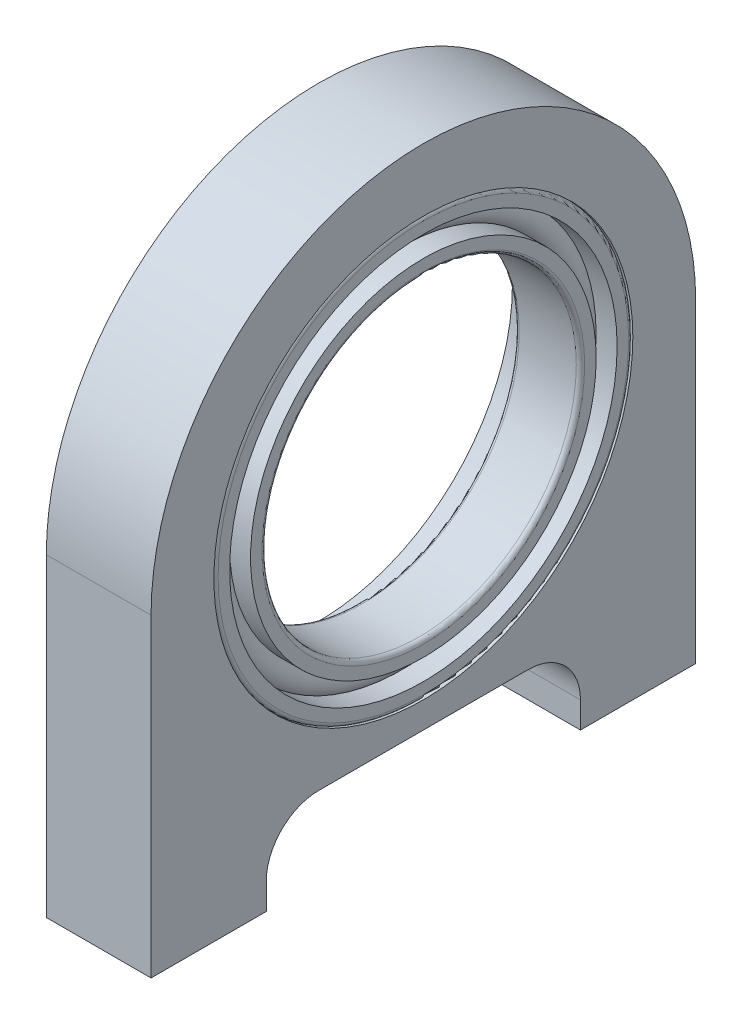
ISO-10303-21;
HEADER;
FILE_DESCRIPTION(('STEP AP214'),'2;1');
FILE_NAME('part.step','',(''),(''),'','','');
FILE_SCHEMA(('AUTOMOTIVE_DESIGN { 1 0 10303 214 1 1 1 1 }'));
ENDSEC;
DATA;
#1=APPLICATION_CONTEXT('core data for automotive mechanical design processes');
#2=APPLICATION_PROTOCOL_DEFINITION('international standard','automotive_design',2000,#1);
#3=PRODUCT_CONTEXT('',#1,'mechanical');
#4=PRODUCT('Part','Part','',(#3));
#5=PRODUCT_RELATED_PRODUCT_CATEGORY('part','',(#4));
#6=PRODUCT_DEFINITION_FORMATION('','',#4);
#7=PRODUCT_DEFINITION_CONTEXT('part definition',#1,'design');
#8=PRODUCT_DEFINITION('design','',#6,#7);
#9=PRODUCT_DEFINITION_SHAPE('','',#8);
#10=(LENGTH_UNIT() NAMED_UNIT(*) SI_UNIT(.MILLI.,.METRE.));
#11=(NAMED_UNIT(*) PLANE_ANGLE_UNIT() SI_UNIT($,.RADIAN.));
#12=(NAMED_UNIT(*) SI_UNIT($,.STERADIAN.) SOLID_ANGLE_UNIT());
#13=UNCERTAINTY_MEASURE_WITH_UNIT(LENGTH_MEASURE(1.E-05),#10,'distance_accuracy_value','');
#14=(GEOMETRIC_REPRESENTATION_CONTEXT(3) GLOBAL_UNCERTAINTY_ASSIGNED_CONTEXT((#13)) GLOBAL_UNIT_ASSIGNED_CONTEXT((#10,
#11,#12)) REPRESENTATION_CONTEXT('',''));
#15=CARTESIAN_POINT('',(0.,0.,0.));
#16=DIRECTION('',(0.,0.,1.));
#17=DIRECTION('',(1.,0.,0.));
#18=AXIS2_PLACEMENT_3D('',#15,#16,#17);
#19=CARTESIAN_POINT('',(0.,0.,0.));
#20=DIRECTION('',(-1.,0.,0.));
#21=DIRECTION('',(0.,0.,1.));
#22=AXIS2_PLACEMENT_3D('',#19,#20,#21);
#23=TOROIDAL_SURFACE('',#22,11.1125,0.9525);
#24=CARTESIAN_POINT('',(0.709951582856175,0.,0.));
#25=DIRECTION('',(-1.,0.,0.));
#26=DIRECTION('',(0.,0.,1.));
#27=AXIS2_PLACEMENT_3D('',#24,#25,#26);
#28=CIRCLE('',#27,11.7475);
#29=CARTESIAN_POINT('',(0.709951582856175,0.,11.7475));
#30=VERTEX_POINT('',#29);
#31=EDGE_CURVE('E213',#30,#30,#28,.F.);
#32=ORIENTED_EDGE('',*,*,#31,.T.);
#33=EDGE_LOOP('',(#32));
#34=FACE_BOUND('',#33,.T.);
#35=CARTESIAN_POINT('',(0.709951582856181,0.,0.));
#36=DIRECTION('',(-1.,0.,0.));
#37=DIRECTION('',(0.,0.,1.));
#38=AXIS2_PLACEMENT_3D('',#35,#36,#37);
#39=CIRCLE('',#38,10.4775);
#40=CARTESIAN_POINT('',(0.709951582856181,0.,10.4775));
#41=VERTEX_POINT('',#40);
#42=EDGE_CURVE('E46',#41,#41,#39,.T.);
#43=ORIENTED_EDGE('',*,*,#42,.T.);
#44=EDGE_LOOP('',(#43));
#45=FACE_BOUND('',#44,.T.);
#46=ADVANCED_FACE('F36',(#34,#45),#23,.T.);
#47=CARTESIAN_POINT('',(-20.6375,0.,0.));
#48=DIRECTION('',(1.,0.,0.));
#49=DIRECTION('',(0.,0.,-1.));
#50=AXIS2_PLACEMENT_3D('',#47,#48,#49);
#51=CYLINDRICAL_SURFACE('',#50,10.4775);
#52=CARTESIAN_POINT('',(1.98374,0.,0.));
#53=DIRECTION('',(1.,0.,0.));
#54=DIRECTION('',(0.,0.,-1.));
#55=AXIS2_PLACEMENT_3D('',#52,#53,#54);
#56=CIRCLE('',#55,10.4775);
#57=CARTESIAN_POINT('',(1.98374,0.,-10.4775));
#58=VERTEX_POINT('',#57);
#59=EDGE_CURVE('E225',#58,#58,#56,.T.);
#60=ORIENTED_EDGE('',*,*,#59,.F.);
#61=EDGE_LOOP('',(#60));
#62=FACE_BOUND('',#61,.T.);
#63=ORIENTED_EDGE('',*,*,#42,.F.);
#64=EDGE_LOOP('',(#63));
#65=FACE_BOUND('',#64,.T.);
#66=ADVANCED_FACE('F256',(#62,#65),#51,.T.);
#67=CARTESIAN_POINT('',(-20.6375,0.,0.));
#68=DIRECTION('',(1.,0.,0.));
#69=DIRECTION('',(0.,0.,-1.));
#70=AXIS2_PLACEMENT_3D('',#67,#68,#69);
#71=CYLINDRICAL_SURFACE('',#70,10.4775);
#72=CARTESIAN_POINT('',(-1.98374,0.,0.));
#73=DIRECTION('',(1.,0.,0.));
#74=DIRECTION('',(0.,0.,-1.));
#75=AXIS2_PLACEMENT_3D('',#72,#73,#74);
#76=CIRCLE('',#75,10.4775);
#77=CARTESIAN_POINT('',(-1.98374,0.,-10.4775));
#78=VERTEX_POINT('',#77);
#79=EDGE_CURVE('E209',#78,#78,#76,.T.);
#80=ORIENTED_EDGE('',*,*,#79,.T.);
#81=EDGE_LOOP('',(#80));
#82=FACE_BOUND('',#81,.T.);
#83=CARTESIAN_POINT('',(-0.709951582856181,0.,0.));
#84=DIRECTION('',(1.,0.,0.));
#85=DIRECTION('',(0.,0.,-1.));
#86=AXIS2_PLACEMENT_3D('',#83,#84,#85);
#87=CIRCLE('',#86,10.4775);
#88=CARTESIAN_POINT('',(-0.709951582856181,0.,-10.4775));
#89=VERTEX_POINT('',#88);
#90=EDGE_CURVE('E228',#89,#89,#87,.T.);
#91=ORIENTED_EDGE('',*,*,#90,.F.);
#92=EDGE_LOOP('',(#91));
#93=FACE_BOUND('',#92,.T.);
#94=ADVANCED_FACE('F260',(#82,#93),#71,.T.);
#95=CARTESIAN_POINT('',(1.98374,9.779,0.));
#96=DIRECTION('',(1.,0.,0.));
#97=DIRECTION('',(0.,0.,-1.));
#98=AXIS2_PLACEMENT_3D('',#95,#96,#97);
#99=PLANE('',#98);
#100=ORIENTED_EDGE('',*,*,#59,.T.);
#101=EDGE_LOOP('',(#100));
#102=FACE_BOUND('',#101,.T.);
#103=CARTESIAN_POINT('',(1.98374,0.,0.));
#104=DIRECTION('',(1.,0.,0.));
#105=DIRECTION('',(0.,0.,-1.));
#106=AXIS2_PLACEMENT_3D('',#103,#104,#105);
#107=CIRCLE('',#106,9.779);
#108=CARTESIAN_POINT('',(1.98374,0.,-9.779));
#109=VERTEX_POINT('',#108);
#110=EDGE_CURVE('E222',#109,#109,#107,.T.);
#111=ORIENTED_EDGE('',*,*,#110,.F.);
#112=EDGE_LOOP('',(#111));
#113=FACE_BOUND('',#112,.T.);
#114=ADVANCED_FACE('F265',(#102,#113),#99,.T.);
#115=CARTESIAN_POINT('',(1.72974,0.,0.));
#116=DIRECTION('',(1.,0.,0.));
#117=DIRECTION('',(0.,0.,-1.));
#118=AXIS2_PLACEMENT_3D('',#115,#116,#117);
#119=TOROIDAL_SURFACE('',#118,9.779,0.254);
#120=ORIENTED_EDGE('',*,*,#110,.T.);
#121=EDGE_LOOP('',(#120));
#122=FACE_BOUND('',#121,.T.);
#123=CARTESIAN_POINT('',(1.72974,0.,0.));
#124=DIRECTION('',(1.,0.,0.));
#125=DIRECTION('',(0.,0.,-1.));
#126=AXIS2_PLACEMENT_3D('',#123,#124,#125);
#127=CIRCLE('',#126,9.525);
#128=CARTESIAN_POINT('',(1.72974,0.,-9.525));
#129=VERTEX_POINT('',#128);
#130=EDGE_CURVE('E219',#129,#129,#127,.T.);
#131=ORIENTED_EDGE('',*,*,#130,.F.);
#132=EDGE_LOOP('',(#131));
#133=FACE_BOUND('',#132,.T.);
#134=ADVANCED_FACE('F272',(#122,#133),#119,.T.);
#135=CARTESIAN_POINT('',(-20.6375,0.,0.));
#136=DIRECTION('',(1.,0.,0.));
#137=DIRECTION('',(0.,0.,-1.));
#138=AXIS2_PLACEMENT_3D('',#135,#136,#137);
#139=CYLINDRICAL_SURFACE('',#138,9.525);
#140=ORIENTED_EDGE('',*,*,#130,.T.);
#141=EDGE_LOOP('',(#140));
#142=FACE_BOUND('',#141,.T.);
#143=CARTESIAN_POINT('',(-1.72974,0.,0.));
#144=DIRECTION('',(1.,0.,0.));
#145=DIRECTION('',(0.,0.,-1.));
#146=AXIS2_PLACEMENT_3D('',#143,#144,#145);
#147=CIRCLE('',#146,9.525);
#148=CARTESIAN_POINT('',(-1.72974,0.,-9.525));
#149=VERTEX_POINT('',#148);
#150=EDGE_CURVE('E216',#149,#149,#147,.T.);
#151=ORIENTED_EDGE('',*,*,#150,.F.);
#152=EDGE_LOOP('',(#151));
#153=FACE_BOUND('',#152,.T.);
#154=ADVANCED_FACE('F276',(#142,#153),#139,.F.);
#155=CARTESIAN_POINT('',(-1.72974,0.,0.));
#156=DIRECTION('',(1.,0.,0.));
#157=DIRECTION('',(0.,0.,-1.));
#158=AXIS2_PLACEMENT_3D('',#155,#156,#157);
#159=TOROIDAL_SURFACE('',#158,9.779,0.254);
#160=ORIENTED_EDGE('',*,*,#150,.T.);
#161=EDGE_LOOP('',(#160));
#162=FACE_BOUND('',#161,.T.);
#163=CARTESIAN_POINT('',(-1.98374,0.,0.));
#164=DIRECTION('',(1.,0.,0.));
#165=DIRECTION('',(0.,0.,-1.));
#166=AXIS2_PLACEMENT_3D('',#163,#164,#165);
#167=CIRCLE('',#166,9.779);
#168=CARTESIAN_POINT('',(-1.98374,0.,-9.779));
#169=VERTEX_POINT('',#168);
#170=EDGE_CURVE('E212',#169,#169,#167,.T.);
#171=ORIENTED_EDGE('',*,*,#170,.F.);
#172=EDGE_LOOP('',(#171));
#173=FACE_BOUND('',#172,.T.);
#174=ADVANCED_FACE('F280',(#162,#173),#159,.T.);
#175=CARTESIAN_POINT('',(-1.98374,10.4775,0.));
#176=DIRECTION('',(-1.,0.,0.));
#177=DIRECTION('',(0.,0.,1.));
#178=AXIS2_PLACEMENT_3D('',#175,#176,#177);
#179=PLANE('',#178);
#180=ORIENTED_EDGE('',*,*,#170,.T.);
#181=EDGE_LOOP('',(#180));
#182=FACE_BOUND('',#181,.T.);
#183=ORIENTED_EDGE('',*,*,#79,.F.);
#184=EDGE_LOOP('',(#183));
#185=FACE_BOUND('',#184,.T.);
#186=ADVANCED_FACE('F251',(#182,#185),#179,.T.);
#187=CARTESIAN_POINT('',(-0.709951582856175,0.,0.));
#188=DIRECTION('',(1.,0.,0.));
#189=DIRECTION('',(0.,0.,-1.));
#190=AXIS2_PLACEMENT_3D('',#187,#188,#189);
#191=CIRCLE('',#190,11.7475);
#192=CARTESIAN_POINT('',(-0.709951582856175,0.,-11.7475));
#193=VERTEX_POINT('',#192);
#194=EDGE_CURVE('E208',#193,#193,#191,.F.);
#195=ORIENTED_EDGE('',*,*,#194,.T.);
#196=EDGE_LOOP('',(#195));
#197=FACE_BOUND('',#196,.T.);
#198=ORIENTED_EDGE('',*,*,#90,.T.);
#199=EDGE_LOOP('',(#198));
#200=FACE_BOUND('',#199,.T.);
#201=ADVANCED_FACE('F38',(#197,#200),#23,.T.);
#202=CARTESIAN_POINT('',(-20.6375,0.,0.));
#203=DIRECTION('',(1.,0.,0.));
#204=DIRECTION('',(0.,0.,-1.));
#205=AXIS2_PLACEMENT_3D('',#202,#203,#204);
#206=CYLINDRICAL_SURFACE('',#205,11.7475);
#207=CARTESIAN_POINT('',(1.98374,0.,0.));
#208=DIRECTION('',(1.,0.,0.));
#209=DIRECTION('',(0.,0.,-1.));
#210=AXIS2_PLACEMENT_3D('',#207,#208,#209);
#211=CIRCLE('',#210,11.7475);
#212=CARTESIAN_POINT('',(1.98374,0.,-11.7475));
#213=VERTEX_POINT('',#212);
#214=EDGE_CURVE('E205',#213,#213,#211,.T.);
#215=ORIENTED_EDGE('',*,*,#214,.T.);
#216=EDGE_LOOP('',(#215));
#217=FACE_BOUND('',#216,.T.);
#218=ORIENTED_EDGE('',*,*,#31,.F.);
#219=EDGE_LOOP('',(#218));
#220=FACE_BOUND('',#219,.T.);
#221=ADVANCED_FACE('F239',(#217,#220),#206,.F.);
#222=CARTESIAN_POINT('',(-20.6375,0.,0.));
#223=DIRECTION('',(1.,0.,0.));
#224=DIRECTION('',(0.,0.,-1.));
#225=AXIS2_PLACEMENT_3D('',#222,#223,#224);
#226=CYLINDRICAL_SURFACE('',#225,11.7475);
#227=ORIENTED_EDGE('',*,*,#194,.F.);
#228=EDGE_LOOP('',(#227));
#229=FACE_BOUND('',#228,.T.);
#230=CARTESIAN_POINT('',(-4.36626,0.,0.));
#231=DIRECTION('',(-1.,0.,0.));
#232=DIRECTION('',(0.,0.,1.));
#233=AXIS2_PLACEMENT_3D('',#230,#231,#232);
#234=CIRCLE('',#233,11.7475);
#235=CARTESIAN_POINT('',(-4.36626,0.,11.7475));
#236=VERTEX_POINT('',#235);
#237=EDGE_CURVE('E550',#236,#236,#234,.T.);
#238=ORIENTED_EDGE('',*,*,#237,.T.);
#239=EDGE_LOOP('',(#238));
#240=FACE_BOUND('',#239,.T.);
#241=ADVANCED_FACE('F241',(#229,#240),#226,.F.);
#242=CARTESIAN_POINT('',(1.98374,12.446,0.));
#243=DIRECTION('',(1.,0.,0.));
#244=DIRECTION('',(0.,0.,-1.));
#245=AXIS2_PLACEMENT_3D('',#242,#243,#244);
#246=PLANE('',#245);
#247=CARTESIAN_POINT('',(1.98374,0.,0.));
#248=DIRECTION('',(1.,0.,0.));
#249=DIRECTION('',(0.,0.,-1.));
#250=AXIS2_PLACEMENT_3D('',#247,#248,#249);
#251=CIRCLE('',#250,12.446);
#252=CARTESIAN_POINT('',(1.98374,0.,-12.446));
#253=VERTEX_POINT('',#252);
#254=EDGE_CURVE('E202',#253,#253,#251,.T.);
#255=ORIENTED_EDGE('',*,*,#254,.T.);
#256=EDGE_LOOP('',(#255));
#257=FACE_BOUND('',#256,.T.);
#258=ORIENTED_EDGE('',*,*,#214,.F.);
#259=EDGE_LOOP('',(#258));
#260=FACE_BOUND('',#259,.T.);
#261=ADVANCED_FACE('F248',(#257,#260),#246,.T.);
#262=CARTESIAN_POINT('',(1.72974,0.,0.));
#263=DIRECTION('',(1.,0.,0.));
#264=DIRECTION('',(0.,0.,-1.));
#265=AXIS2_PLACEMENT_3D('',#262,#263,#264);
#266=TOROIDAL_SURFACE('',#265,12.446,0.254);
#267=CARTESIAN_POINT('',(1.72974,0.,0.));
#268=DIRECTION('',(1.,0.,0.));
#269=DIRECTION('',(0.,0.,-1.));
#270=AXIS2_PLACEMENT_3D('',#267,#268,#269);
#271=CIRCLE('',#270,12.7);
#272=CARTESIAN_POINT('',(1.72974,0.,-12.7));
#273=VERTEX_POINT('',#272);
#274=EDGE_CURVE('E183',#273,#273,#271,.F.);
#275=ORIENTED_EDGE('',*,*,#274,.F.);
#276=EDGE_LOOP('',(#275));
#277=FACE_BOUND('',#276,.T.);
#278=ORIENTED_EDGE('',*,*,#254,.F.);
#279=EDGE_LOOP('',(#278));
#280=FACE_BOUND('',#279,.T.);
#281=ADVANCED_FACE('F319',(#277,#280),#266,.T.);
#282=CARTESIAN_POINT('',(-4.36626,0.,0.));
#283=DIRECTION('',(1.,0.,0.));
#284=DIRECTION('',(0.,0.,-1.));
#285=AXIS2_PLACEMENT_3D('',#282,#283,#284);
#286=CYLINDRICAL_SURFACE('',#285,12.7);
#287=CARTESIAN_POINT('',(1.98374,0.,0.));
#288=DIRECTION('',(1.,0.,0.));
#289=DIRECTION('',(0.,0.,-1.));
#290=AXIS2_PLACEMENT_3D('',#287,#288,#289);
#291=CIRCLE('',#290,12.7);
#292=CARTESIAN_POINT('',(1.98374,0.,-12.7));
#293=VERTEX_POINT('',#292);
#294=EDGE_CURVE('E157',#293,#293,#291,.T.);
#295=ORIENTED_EDGE('',*,*,#294,.T.);
#296=EDGE_LOOP('',(#295));
#297=FACE_BOUND('',#296,.T.);
#298=ORIENTED_EDGE('',*,*,#274,.T.);
#299=EDGE_LOOP('',(#298));
#300=FACE_BOUND('',#299,.T.);
#301=ADVANCED_FACE('F328',(#297,#300),#286,.F.);
#302=CARTESIAN_POINT('',(-4.36626,-19.05,9.525));
#303=DIRECTION('',(0.,-1.,0.));
#304=DIRECTION('',(0.,0.,-1.));
#305=AXIS2_PLACEMENT_3D('',#302,#303,#304);
#306=PLANE('',#305);
#307=CARTESIAN_POINT('',(-1.19126,-19.05,13.4703841816037));
#308=DIRECTION('',(0.,-1.,0.));
#309=DIRECTION('',(0.,0.,-1.));
#310=AXIS2_PLACEMENT_3D('',#307,#308,#309);
#311=CIRCLE('',#310,1.35254999999999);
#312=CARTESIAN_POINT('',(-1.19126,-19.05,12.1178341816037));
#313=VERTEX_POINT('',#312);
#314=EDGE_CURVE('E540',#313,#313,#311,.T.);
#315=ORIENTED_EDGE('',*,*,#314,.F.);
#316=EDGE_LOOP('',(#315));
#317=FACE_BOUND('',#316,.T.);
#318=DIRECTION('',(0.,0.,-1.));
#319=VECTOR('',#318,1.);
#320=CARTESIAN_POINT('',(1.98374,-19.05,9.525));
#321=LINE('',#320,#319);
#322=CARTESIAN_POINT('',(1.98374,-19.05,16.51));
#323=VERTEX_POINT('',#322);
#324=CARTESIAN_POINT('',(1.98374,-19.05,9.525));
#325=VERTEX_POINT('',#324);
#326=EDGE_CURVE('E153',#323,#325,#321,.T.);
#327=ORIENTED_EDGE('',*,*,#326,.F.);
#328=DIRECTION('',(1.,0.,0.));
#329=VECTOR('',#328,1.);
#330=CARTESIAN_POINT('',(-4.36626,-19.05,16.51));
#331=LINE('',#330,#329);
#332=CARTESIAN_POINT('',(-4.36626,-19.05,16.51));
#333=VERTEX_POINT('',#332);
#334=EDGE_CURVE('E54',#333,#323,#331,.T.);
#335=ORIENTED_EDGE('',*,*,#334,.F.);
#336=DIRECTION('',(0.,0.,-1.));
#337=VECTOR('',#336,1.);
#338=CARTESIAN_POINT('',(-4.36626,-19.05,9.525));
#339=LINE('',#338,#337);
#340=CARTESIAN_POINT('',(-4.36626,-19.05,9.525));
#341=VERTEX_POINT('',#340);
#342=EDGE_CURVE('E181',#333,#341,#339,.T.);
#343=ORIENTED_EDGE('',*,*,#342,.T.);
#344=DIRECTION('',(1.,0.,0.));
#345=VECTOR('',#344,1.);
#346=CARTESIAN_POINT('',(-4.36626,-19.05,9.525));
#347=LINE('',#346,#345);
#348=EDGE_CURVE('E102',#341,#325,#347,.T.);
#349=ORIENTED_EDGE('',*,*,#348,.T.);
#350=EDGE_LOOP('',(#327,#335,#343,#349));
#351=FACE_BOUND('',#350,.T.);
#352=ADVANCED_FACE('F351',(#317,#351),#306,.T.);
#353=CARTESIAN_POINT('',(-4.36626,0.,16.51));
#354=DIRECTION('',(0.,0.,1.));
#355=DIRECTION('',(1.,0.,0.));
#356=AXIS2_PLACEMENT_3D('',#353,#354,#355);
#357=PLANE('',#356);
#358=DIRECTION('',(0.,-1.,0.));
#359=VECTOR('',#358,1.);
#360=CARTESIAN_POINT('',(1.98374,0.,16.51));
#361=LINE('',#360,#359);
#362=CARTESIAN_POINT('',(1.98374,0.,16.51));
#363=VERTEX_POINT('',#362);
#364=EDGE_CURVE('E178',#363,#323,#361,.T.);
#365=ORIENTED_EDGE('',*,*,#364,.F.);
#366=DIRECTION('',(1.,0.,0.));
#367=VECTOR('',#366,1.);
#368=CARTESIAN_POINT('',(-4.36626,0.,16.51));
#369=LINE('',#368,#367);
#370=CARTESIAN_POINT('',(-4.36626,0.,16.51));
#371=VERTEX_POINT('',#370);
#372=EDGE_CURVE('E90',#371,#363,#369,.T.);
#373=ORIENTED_EDGE('',*,*,#372,.F.);
#374=DIRECTION('',(0.,-1.,0.));
#375=VECTOR('',#374,1.);
#376=CARTESIAN_POINT('',(-4.36626,0.,16.51));
#377=LINE('',#376,#375);
#378=EDGE_CURVE('E143',#371,#333,#377,.T.);
#379=ORIENTED_EDGE('',*,*,#378,.T.);
#380=ORIENTED_EDGE('',*,*,#334,.T.);
#381=EDGE_LOOP('',(#365,#373,#379,#380));
#382=FACE_BOUND('',#381,.T.);
#383=ADVANCED_FACE('F359',(#382),#357,.T.);
#384=CARTESIAN_POINT('',(-4.36626,0.,0.));
#385=DIRECTION('',(1.,0.,0.));
#386=DIRECTION('',(0.,0.,-1.));
#387=AXIS2_PLACEMENT_3D('',#384,#385,#386);
#388=CYLINDRICAL_SURFACE('',#387,16.51);
#389=CARTESIAN_POINT('',(1.98374,0.,0.));
#390=DIRECTION('',(1.,0.,0.));
#391=DIRECTION('',(0.,0.,-1.));
#392=AXIS2_PLACEMENT_3D('',#389,#390,#391);
#393=CIRCLE('',#392,16.51);
#394=CARTESIAN_POINT('',(1.98374,0.,-16.51));
#395=VERTEX_POINT('',#394);
#396=EDGE_CURVE('E129',#395,#363,#393,.T.);
#397=ORIENTED_EDGE('',*,*,#396,.F.);
#398=DIRECTION('',(1.,0.,0.));
#399=VECTOR('',#398,1.);
#400=CARTESIAN_POINT('',(-4.36626,0.,-16.51));
#401=LINE('',#400,#399);
#402=CARTESIAN_POINT('',(-4.36626,0.,-16.51));
#403=VERTEX_POINT('',#402);
#404=EDGE_CURVE('E124',#403,#395,#401,.T.);
#405=ORIENTED_EDGE('',*,*,#404,.F.);
#406=CARTESIAN_POINT('',(-4.36626,0.,0.));
#407=DIRECTION('',(1.,0.,0.));
#408=DIRECTION('',(0.,0.,-1.));
#409=AXIS2_PLACEMENT_3D('',#406,#407,#408);
#410=CIRCLE('',#409,16.51);
#411=EDGE_CURVE('E127',#403,#371,#410,.T.);
#412=ORIENTED_EDGE('',*,*,#411,.T.);
#413=ORIENTED_EDGE('',*,*,#372,.T.);
#414=EDGE_LOOP('',(#397,#405,#412,#413));
#415=FACE_BOUND('',#414,.T.);
#416=ADVANCED_FACE('F126',(#415),#388,.T.);
#417=CARTESIAN_POINT('',(-4.36626,0.,-16.51));
#418=DIRECTION('',(0.,0.,-1.));
#419=DIRECTION('',(-1.,0.,0.));
#420=AXIS2_PLACEMENT_3D('',#417,#418,#419);
#421=PLANE('',#420);
#422=DIRECTION('',(0.,1.,0.));
#423=VECTOR('',#422,1.);
#424=CARTESIAN_POINT('',(1.98374,0.,-16.51));
#425=LINE('',#424,#423);
#426=CARTESIAN_POINT('',(1.98374,-19.05,-16.51));
#427=VERTEX_POINT('',#426);
#428=EDGE_CURVE('E175',#427,#395,#425,.T.);
#429=ORIENTED_EDGE('',*,*,#428,.F.);
#430=DIRECTION('',(1.,0.,0.));
#431=VECTOR('',#430,1.);
#432=CARTESIAN_POINT('',(-4.36626,-19.05,-16.51));
#433=LINE('',#432,#431);
#434=CARTESIAN_POINT('',(-4.36626,-19.05,-16.51));
#435=VERTEX_POINT('',#434);
#436=EDGE_CURVE('E134',#435,#427,#433,.T.);
#437=ORIENTED_EDGE('',*,*,#436,.F.);
#438=DIRECTION('',(0.,1.,0.));
#439=VECTOR('',#438,1.);
#440=CARTESIAN_POINT('',(-4.36626,0.,-16.51));
#441=LINE('',#440,#439);
#442=EDGE_CURVE('E141',#435,#403,#441,.T.);
#443=ORIENTED_EDGE('',*,*,#442,.T.);
#444=ORIENTED_EDGE('',*,*,#404,.T.);
#445=EDGE_LOOP('',(#429,#437,#443,#444));
#446=FACE_BOUND('',#445,.T.);
#447=ADVANCED_FACE('F145',(#446),#421,.T.);
#448=CARTESIAN_POINT('',(-4.36626,-19.05,-16.51));
#449=DIRECTION('',(0.,-1.,0.));
#450=DIRECTION('',(0.,0.,-1.));
#451=AXIS2_PLACEMENT_3D('',#448,#449,#450);
#452=PLANE('',#451);
#453=CARTESIAN_POINT('',(-1.19126,-19.05,-13.4703841816037));
#454=DIRECTION('',(0.,-1.,0.));
#455=DIRECTION('',(0.,0.,-1.));
#456=AXIS2_PLACEMENT_3D('',#453,#454,#455);
#457=CIRCLE('',#456,1.35254999999999);
#458=CARTESIAN_POINT('',(-1.19126,-19.05,-14.8229341816037));
#459=VERTEX_POINT('',#458);
#460=EDGE_CURVE('E542',#459,#459,#457,.T.);
#461=ORIENTED_EDGE('',*,*,#460,.F.);
#462=EDGE_LOOP('',(#461));
#463=FACE_BOUND('',#462,.T.);
#464=DIRECTION('',(0.,0.,-1.));
#465=VECTOR('',#464,1.);
#466=CARTESIAN_POINT('',(1.98374,-19.05,-16.51));
#467=LINE('',#466,#465);
#468=CARTESIAN_POINT('',(1.98374,-19.05,-9.52500000000001));
#469=VERTEX_POINT('',#468);
#470=EDGE_CURVE('E172',#469,#427,#467,.T.);
#471=ORIENTED_EDGE('',*,*,#470,.F.);
#472=DIRECTION('',(1.,0.,0.));
#473=VECTOR('',#472,1.);
#474=CARTESIAN_POINT('',(-4.36626,-19.05,-9.52500000000001));
#475=LINE('',#474,#473);
#476=CARTESIAN_POINT('',(-4.36626,-19.05,-9.52500000000001));
#477=VERTEX_POINT('',#476);
#478=EDGE_CURVE('E186',#477,#469,#475,.T.);
#479=ORIENTED_EDGE('',*,*,#478,.F.);
#480=DIRECTION('',(0.,0.,-1.));
#481=VECTOR('',#480,1.);
#482=CARTESIAN_POINT('',(-4.36626,-19.05,-16.51));
#483=LINE('',#482,#481);
#484=EDGE_CURVE('E146',#477,#435,#483,.T.);
#485=ORIENTED_EDGE('',*,*,#484,.T.);
#486=ORIENTED_EDGE('',*,*,#436,.T.);
#487=EDGE_LOOP('',(#471,#479,#485,#486));
#488=FACE_BOUND('',#487,.T.);
#489=ADVANCED_FACE('F380',(#463,#488),#452,.T.);
#490=CARTESIAN_POINT('',(-4.36626,-17.4625,-9.52500000000001));
#491=DIRECTION('',(0.,0.,1.));
#492=DIRECTION('',(0.,-1.,0.));
#493=AXIS2_PLACEMENT_3D('',#490,#491,#492);
#494=PLANE('',#493);
#495=DIRECTION('',(0.,-1.,0.));
#496=VECTOR('',#495,1.);
#497=CARTESIAN_POINT('',(1.98374,-17.4625,-9.52500000000001));
#498=LINE('',#497,#496);
#499=CARTESIAN_POINT('',(1.98374,-17.4625,-9.52500000000001));
#500=VERTEX_POINT('',#499);
#501=EDGE_CURVE('E169',#500,#469,#498,.T.);
#502=ORIENTED_EDGE('',*,*,#501,.F.);
#503=DIRECTION('',(1.,0.,0.));
#504=VECTOR('',#503,1.);
#505=CARTESIAN_POINT('',(-4.36626,-17.4625,-9.52500000000001));
#506=LINE('',#505,#504);
#507=CARTESIAN_POINT('',(-4.36626,-17.4625,-9.52500000000001));
#508=VERTEX_POINT('',#507);
#509=EDGE_CURVE('E188',#508,#500,#506,.T.);
#510=ORIENTED_EDGE('',*,*,#509,.F.);
#511=DIRECTION('',(0.,-1.,0.));
#512=VECTOR('',#511,1.);
#513=CARTESIAN_POINT('',(-4.36626,-17.4625,-9.52500000000001));
#514=LINE('',#513,#512);
#515=EDGE_CURVE('E148',#508,#477,#514,.T.);
#516=ORIENTED_EDGE('',*,*,#515,.T.);
#517=ORIENTED_EDGE('',*,*,#478,.T.);
#518=EDGE_LOOP('',(#502,#510,#516,#517));
#519=FACE_BOUND('',#518,.T.);
#520=ADVANCED_FACE('F387',(#519),#494,.T.);
#521=CARTESIAN_POINT('',(-4.36626,-17.4625,-6.35000000000001));
#522=DIRECTION('',(1.,0.,0.));
#523=DIRECTION('',(0.,0.,-1.));
#524=AXIS2_PLACEMENT_3D('',#521,#522,#523);
#525=CYLINDRICAL_SURFACE('',#524,3.175);
#526=CARTESIAN_POINT('',(1.98374,-17.4625,-6.35000000000001));
#527=DIRECTION('',(-1.,0.,0.));
#528=DIRECTION('',(0.,0.,-1.));
#529=AXIS2_PLACEMENT_3D('',#526,#527,#528);
#530=CIRCLE('',#529,3.175);
#531=CARTESIAN_POINT('',(1.98374,-14.2875,-6.34999999999999));
#532=VERTEX_POINT('',#531);
#533=EDGE_CURVE('E166',#532,#500,#530,.T.);
#534=ORIENTED_EDGE('',*,*,#533,.F.);
#535=DIRECTION('',(1.,0.,0.));
#536=VECTOR('',#535,1.);
#537=CARTESIAN_POINT('',(-4.36626,-14.2875,-6.34999999999999));
#538=LINE('',#537,#536);
#539=CARTESIAN_POINT('',(-4.36626,-14.2875,-6.34999999999999));
#540=VERTEX_POINT('',#539);
#541=EDGE_CURVE('E190',#540,#532,#538,.T.);
#542=ORIENTED_EDGE('',*,*,#541,.F.);
#543=CARTESIAN_POINT('',(-4.36626,-17.4625,-6.35000000000001));
#544=DIRECTION('',(-1.,0.,0.));
#545=DIRECTION('',(0.,0.,-1.));
#546=AXIS2_PLACEMENT_3D('',#543,#544,#545);
#547=CIRCLE('',#546,3.175);
#548=EDGE_CURVE('E567',#540,#508,#547,.T.);
#549=ORIENTED_EDGE('',*,*,#548,.T.);
#550=ORIENTED_EDGE('',*,*,#509,.T.);
#551=EDGE_LOOP('',(#534,#542,#549,#550));
#552=FACE_BOUND('',#551,.T.);
#553=ADVANCED_FACE('F392',(#552),#525,.F.);
#554=CARTESIAN_POINT('',(-4.36626,-14.2875,-6.34999999999999));
#555=DIRECTION('',(0.,-1.,0.));
#556=DIRECTION('',(0.,0.,-1.));
#557=AXIS2_PLACEMENT_3D('',#554,#555,#556);
#558=PLANE('',#557);
#559=DIRECTION('',(0.,0.,-1.));
#560=VECTOR('',#559,1.);
#561=CARTESIAN_POINT('',(1.98374,-14.2875,-6.34999999999999));
#562=LINE('',#561,#560);
#563=CARTESIAN_POINT('',(1.98374,-14.2875,6.34999999999997));
#564=VERTEX_POINT('',#563);
#565=EDGE_CURVE('E163',#564,#532,#562,.T.);
#566=ORIENTED_EDGE('',*,*,#565,.F.);
#567=DIRECTION('',(1.,0.,0.));
#568=VECTOR('',#567,1.);
#569=CARTESIAN_POINT('',(-4.36626,-14.2875,6.34999999999997));
#570=LINE('',#569,#568);
#571=CARTESIAN_POINT('',(-4.36626,-14.2875,6.34999999999997));
#572=VERTEX_POINT('',#571);
#573=EDGE_CURVE('E192',#572,#564,#570,.T.);
#574=ORIENTED_EDGE('',*,*,#573,.F.);
#575=DIRECTION('',(0.,0.,-1.));
#576=VECTOR('',#575,1.);
#577=CARTESIAN_POINT('',(-4.36626,-14.2875,-6.34999999999999));
#578=LINE('',#577,#576);
#579=EDGE_CURVE('E564',#572,#540,#578,.T.);
#580=ORIENTED_EDGE('',*,*,#579,.T.);
#581=ORIENTED_EDGE('',*,*,#541,.T.);
#582=EDGE_LOOP('',(#566,#574,#580,#581));
#583=FACE_BOUND('',#582,.T.);
#584=ADVANCED_FACE('F402',(#583),#558,.T.);
#585=CARTESIAN_POINT('',(-4.36626,-17.4625,6.35));
#586=DIRECTION('',(1.,0.,0.));
#587=DIRECTION('',(0.,0.,-1.));
#588=AXIS2_PLACEMENT_3D('',#585,#586,#587);
#589=CYLINDRICAL_SURFACE('',#588,3.175);
#590=CARTESIAN_POINT('',(1.98374,-17.4625,6.35));
#591=DIRECTION('',(-1.,0.,0.));
#592=DIRECTION('',(0.,0.,-1.));
#593=AXIS2_PLACEMENT_3D('',#590,#591,#592);
#594=CIRCLE('',#593,3.175);
#595=CARTESIAN_POINT('',(1.98374,-17.4625,9.525));
#596=VERTEX_POINT('',#595);
#597=EDGE_CURVE('E160',#596,#564,#594,.T.);
#598=ORIENTED_EDGE('',*,*,#597,.F.);
#599=DIRECTION('',(1.,0.,0.));
#600=VECTOR('',#599,1.);
#601=CARTESIAN_POINT('',(-4.36626,-17.4625,9.525));
#602=LINE('',#601,#600);
#603=CARTESIAN_POINT('',(-4.36626,-17.4625,9.525));
#604=VERTEX_POINT('',#603);
#605=EDGE_CURVE('E194',#604,#596,#602,.T.);
#606=ORIENTED_EDGE('',*,*,#605,.F.);
#607=CARTESIAN_POINT('',(-4.36626,-17.4625,6.35));
#608=DIRECTION('',(-1.,0.,0.));
#609=DIRECTION('',(0.,0.,-1.));
#610=AXIS2_PLACEMENT_3D('',#607,#608,#609);
#611=CIRCLE('',#610,3.175);
#612=EDGE_CURVE('E561',#604,#572,#611,.T.);
#613=ORIENTED_EDGE('',*,*,#612,.T.);
#614=ORIENTED_EDGE('',*,*,#573,.T.);
#615=EDGE_LOOP('',(#598,#606,#613,#614));
#616=FACE_BOUND('',#615,.T.);
#617=ADVANCED_FACE('F412',(#616),#589,.F.);
#618=CARTESIAN_POINT('',(-4.36626,-17.4625,9.525));
#619=DIRECTION('',(0.,0.,-1.));
#620=DIRECTION('',(-1.,0.,0.));
#621=AXIS2_PLACEMENT_3D('',#618,#619,#620);
#622=PLANE('',#621);
#623=DIRECTION('',(0.,1.,0.));
#624=VECTOR('',#623,1.);
#625=CARTESIAN_POINT('',(1.98374,-17.4625,9.525));
#626=LINE('',#625,#624);
#627=EDGE_CURVE('E156',#325,#596,#626,.T.);
#628=ORIENTED_EDGE('',*,*,#627,.F.);
#629=ORIENTED_EDGE('',*,*,#348,.F.);
#630=DIRECTION('',(0.,1.,0.));
#631=VECTOR('',#630,1.);
#632=CARTESIAN_POINT('',(-4.36626,-17.4625,9.525));
#633=LINE('',#632,#631);
#634=EDGE_CURVE('E559',#341,#604,#633,.T.);
#635=ORIENTED_EDGE('',*,*,#634,.T.);
#636=ORIENTED_EDGE('',*,*,#605,.T.);
#637=EDGE_LOOP('',(#628,#629,#635,#636));
#638=FACE_BOUND('',#637,.T.);
#639=ADVANCED_FACE('F422',(#638),#622,.T.);
#640=CARTESIAN_POINT('',(-4.36626,0.,0.));
#641=DIRECTION('',(1.,0.,0.));
#642=DIRECTION('',(0.,0.,-1.));
#643=AXIS2_PLACEMENT_3D('',#640,#641,#642);
#644=PLANE('',#643);
#645=ORIENTED_EDGE('',*,*,#342,.F.);
#646=ORIENTED_EDGE('',*,*,#378,.F.);
#647=ORIENTED_EDGE('',*,*,#411,.F.);
#648=ORIENTED_EDGE('',*,*,#442,.F.);
#649=ORIENTED_EDGE('',*,*,#484,.F.);
#650=ORIENTED_EDGE('',*,*,#515,.F.);
#651=ORIENTED_EDGE('',*,*,#548,.F.);
#652=ORIENTED_EDGE('',*,*,#579,.F.);
#653=ORIENTED_EDGE('',*,*,#612,.F.);
#654=ORIENTED_EDGE('',*,*,#634,.F.);
#655=EDGE_LOOP('',(#645,#646,#647,#648,#649,#650,#651,#652,#653,#654));
#656=FACE_BOUND('',#655,.T.);
#657=ORIENTED_EDGE('',*,*,#237,.F.);
#658=EDGE_LOOP('',(#657));
#659=FACE_BOUND('',#658,.T.);
#660=ADVANCED_FACE('F138',(#656,#659),#644,.F.);
#661=CARTESIAN_POINT('',(1.98374,0.,0.));
#662=DIRECTION('',(1.,0.,0.));
#663=DIRECTION('',(0.,0.,-1.));
#664=AXIS2_PLACEMENT_3D('',#661,#662,#663);
#665=PLANE('',#664);
#666=ORIENTED_EDGE('',*,*,#294,.F.);
#667=EDGE_LOOP('',(#666));
#668=FACE_BOUND('',#667,.T.);
#669=ORIENTED_EDGE('',*,*,#326,.T.);
#670=ORIENTED_EDGE('',*,*,#627,.T.);
#671=ORIENTED_EDGE('',*,*,#597,.T.);
#672=ORIENTED_EDGE('',*,*,#565,.T.);
#673=ORIENTED_EDGE('',*,*,#533,.T.);
#674=ORIENTED_EDGE('',*,*,#501,.T.);
#675=ORIENTED_EDGE('',*,*,#470,.T.);
#676=ORIENTED_EDGE('',*,*,#428,.T.);
#677=ORIENTED_EDGE('',*,*,#396,.T.);
#678=ORIENTED_EDGE('',*,*,#364,.T.);
#679=EDGE_LOOP('',(#669,#670,#671,#672,#673,#674,#675,#676,#677,#678));
#680=FACE_BOUND('',#679,.T.);
#681=ADVANCED_FACE('F438',(#668,#680),#665,.T.);
#682=CARTESIAN_POINT('',(-1.19126,-9.66215999999999,-13.4703841816037));
#683=DIRECTION('',(0.,-1.,0.));
#684=DIRECTION('',(0.,0.,-1.));
#685=AXIS2_PLACEMENT_3D('',#682,#683,#684);
#686=CONICAL_SURFACE('',#685,1.35255,1.02974425867665);
#687=CARTESIAN_POINT('',(-1.19126,-8.84946596973427,-13.4703841816037));
#688=VERTEX_POINT('',#687);
#689=VERTEX_LOOP('',#688);
#690=FACE_BOUND('',#689,.T.);
#691=CARTESIAN_POINT('',(-1.19126,-9.66215999999999,-13.4703841816037));
#692=DIRECTION('',(0.,-1.,0.));
#693=DIRECTION('',(0.,0.,-1.));
#694=AXIS2_PLACEMENT_3D('',#691,#692,#693);
#695=CIRCLE('',#694,1.35255);
#696=CARTESIAN_POINT('',(-1.19126,-9.66215999999999,-14.8229341816037));
#697=VERTEX_POINT('',#696);
#698=EDGE_CURVE('E547',#697,#697,#695,.T.);
#699=ORIENTED_EDGE('',*,*,#698,.T.);
#700=EDGE_LOOP('',(#699));
#701=FACE_BOUND('',#700,.T.);
#702=ADVANCED_FACE('F443',(#690,#701),#686,.F.);
#703=CARTESIAN_POINT('',(-1.19126,-19.05,-13.4703841816037));
#704=DIRECTION('',(0.,-1.,0.));
#705=DIRECTION('',(0.,0.,-1.));
#706=AXIS2_PLACEMENT_3D('',#703,#704,#705);
#707=CYLINDRICAL_SURFACE('',#706,1.35254999999999);
#708=ORIENTED_EDGE('',*,*,#698,.F.);
#709=EDGE_LOOP('',(#708));
#710=FACE_BOUND('',#709,.T.);
#711=ORIENTED_EDGE('',*,*,#460,.T.);
#712=EDGE_LOOP('',(#711));
#713=FACE_BOUND('',#712,.T.);
#714=ADVANCED_FACE('F498',(#710,#713),#707,.F.);
#715=CARTESIAN_POINT('',(-1.19126,-9.66215999999999,13.4703841816037));
#716=DIRECTION('',(0.,-1.,0.));
#717=DIRECTION('',(0.,0.,-1.));
#718=AXIS2_PLACEMENT_3D('',#715,#716,#717);
#719=CONICAL_SURFACE('',#718,1.35255,1.02974425867665);
#720=CARTESIAN_POINT('',(-1.19126,-8.84946596973427,13.4703841816037));
#721=VERTEX_POINT('',#720);
#722=VERTEX_LOOP('',#721);
#723=FACE_BOUND('',#722,.T.);
#724=CARTESIAN_POINT('',(-1.19126,-9.66215999999999,13.4703841816037));
#725=DIRECTION('',(0.,-1.,0.));
#726=DIRECTION('',(0.,0.,-1.));
#727=AXIS2_PLACEMENT_3D('',#724,#725,#726);
#728=CIRCLE('',#727,1.35255);
#729=CARTESIAN_POINT('',(-1.19126,-9.66215999999999,12.1178341816037));
#730=VERTEX_POINT('',#729);
#731=EDGE_CURVE('E537',#730,#730,#728,.T.);
#732=ORIENTED_EDGE('',*,*,#731,.T.);
#733=EDGE_LOOP('',(#732));
#734=FACE_BOUND('',#733,.T.);
#735=ADVANCED_FACE('F509',(#723,#734),#719,.F.);
#736=CARTESIAN_POINT('',(-1.19126,-19.05,13.4703841816037));
#737=DIRECTION('',(0.,-1.,0.));
#738=DIRECTION('',(0.,0.,-1.));
#739=AXIS2_PLACEMENT_3D('',#736,#737,#738);
#740=CYLINDRICAL_SURFACE('',#739,1.35254999999999);
#741=ORIENTED_EDGE('',*,*,#731,.F.);
#742=EDGE_LOOP('',(#741));
#743=FACE_BOUND('',#742,.T.);
#744=ORIENTED_EDGE('',*,*,#314,.T.);
#745=EDGE_LOOP('',(#744));
#746=FACE_BOUND('',#745,.T.);
#747=ADVANCED_FACE('F520',(#743,#746),#740,.F.);
#748=CLOSED_SHELL('',(#46,#66,#94,#114,#134,#154,#174,#186,#201,#221,#241,#261,#281,#301,#352,
#383,#416,#447,#489,#520,#553,#584,#617,#639,#660,#681,#702,#714,#735,#747));
#749=CARTESIAN_POINT('',(-1.98374,11.7475,0.));
#750=DIRECTION('',(-1.,0.,0.));
#751=DIRECTION('',(0.,0.,1.));
#752=AXIS2_PLACEMENT_3D('',#749,#750,#751);
#753=PLANE('',#752);
#754=CARTESIAN_POINT('',(-1.98374,0.,0.));
#755=DIRECTION('',(-1.,0.,0.));
#756=DIRECTION('',(0.,0.,1.));
#757=AXIS2_PLACEMENT_3D('',#754,#755,#756);
#758=CIRCLE('',#757,12.7);
#759=CARTESIAN_POINT('',(-1.98374,0.,12.7));
#760=VERTEX_POINT('',#759);
#761=EDGE_CURVE('E11',#760,#760,#758,.F.);
#762=ORIENTED_EDGE('',*,*,#761,.T.);
#763=EDGE_LOOP('',(#762));
#764=FACE_BOUND('',#763,.T.);
#765=CARTESIAN_POINT('',(-1.98374,0.,0.));
#766=DIRECTION('',(1.,0.,0.));
#767=DIRECTION('',(0.,0.,-1.));
#768=AXIS2_PLACEMENT_3D('',#765,#766,#767);
#769=CIRCLE('',#768,12.446);
#770=CARTESIAN_POINT('',(-1.98374,0.,-12.446));
#771=VERTEX_POINT('',#770);
#772=EDGE_CURVE('E553',#771,#771,#769,.F.);
#773=ORIENTED_EDGE('',*,*,#772,.T.);
#774=EDGE_LOOP('',(#773));
#775=FACE_BOUND('',#774,.T.);
#776=ADVANCED_FACE('F465',(#764,#775),#753,.F.);
#777=CARTESIAN_POINT('',(-1.72974,0.,0.));
#778=DIRECTION('',(1.,0.,0.));
#779=DIRECTION('',(0.,0.,-1.));
#780=AXIS2_PLACEMENT_3D('',#777,#778,#779);
#781=CIRCLE('',#780,12.7);
#782=CARTESIAN_POINT('',(-1.72974,0.,-12.7));
#783=VERTEX_POINT('',#782);
#784=EDGE_CURVE('E199',#783,#783,#781,.T.);
#785=ORIENTED_EDGE('',*,*,#784,.T.);
#786=EDGE_LOOP('',(#785));
#787=FACE_BOUND('',#786,.T.);
#788=ORIENTED_EDGE('',*,*,#761,.F.);
#789=EDGE_LOOP('',(#788));
#790=FACE_BOUND('',#789,.T.);
#791=ADVANCED_FACE('F340',(#787,#790),#286,.F.);
#792=CARTESIAN_POINT('',(-1.72974,0.,0.));
#793=DIRECTION('',(1.,0.,0.));
#794=DIRECTION('',(0.,0.,-1.));
#795=AXIS2_PLACEMENT_3D('',#792,#793,#794);
#796=TOROIDAL_SURFACE('',#795,12.446,0.254);
#797=ORIENTED_EDGE('',*,*,#772,.F.);
#798=EDGE_LOOP('',(#797));
#799=FACE_BOUND('',#798,.T.);
#800=ORIENTED_EDGE('',*,*,#784,.F.);
#801=EDGE_LOOP('',(#800));
#802=FACE_BOUND('',#801,.T.);
#803=ADVANCED_FACE('F336',(#799,#802),#796,.T.);
#804=CLOSED_SHELL('',(#776,#791,#803));
#805=ORIENTED_CLOSED_SHELL('',*,#804,.T.);
#806=BREP_WITH_VOIDS('B2',#748,(#805));
#807=ADVANCED_BREP_SHAPE_REPRESENTATION('',(#18,#806),#14);
#808=SHAPE_DEFINITION_REPRESENTATION(#9,#807);
ENDSEC;
END-ISO-10303-21;
